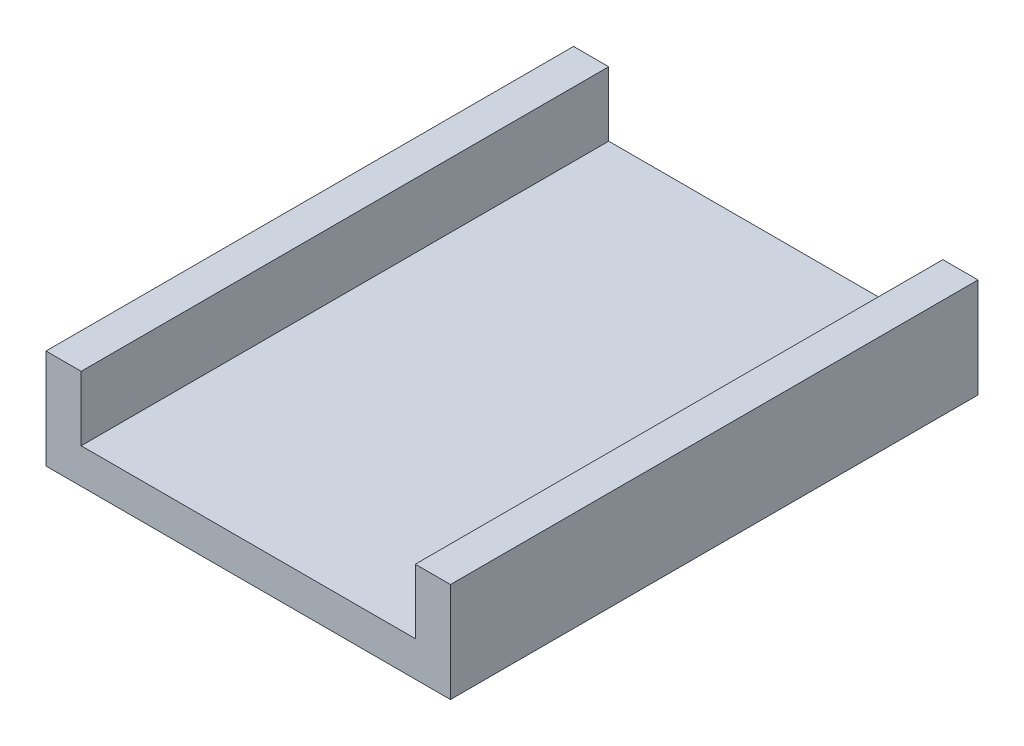
ISO-10303-21;
HEADER;
FILE_DESCRIPTION(('STEP AP214'),'2;1');
FILE_NAME('part.step','',(''),(''),'','','');
FILE_SCHEMA(('AUTOMOTIVE_DESIGN { 1 0 10303 214 1 1 1 1 }'));
ENDSEC;
DATA;
#1=APPLICATION_CONTEXT('core data for automotive mechanical design processes');
#2=APPLICATION_PROTOCOL_DEFINITION('international standard','automotive_design',2000,#1);
#3=PRODUCT_CONTEXT('',#1,'mechanical');
#4=PRODUCT('Part','Part','',(#3));
#5=PRODUCT_RELATED_PRODUCT_CATEGORY('part','',(#4));
#6=PRODUCT_DEFINITION_FORMATION('','',#4);
#7=PRODUCT_DEFINITION_CONTEXT('part definition',#1,'design');
#8=PRODUCT_DEFINITION('design','',#6,#7);
#9=PRODUCT_DEFINITION_SHAPE('','',#8);
#10=(LENGTH_UNIT() NAMED_UNIT(*) SI_UNIT(.MILLI.,.METRE.));
#11=(NAMED_UNIT(*) PLANE_ANGLE_UNIT() SI_UNIT($,.RADIAN.));
#12=(NAMED_UNIT(*) SI_UNIT($,.STERADIAN.) SOLID_ANGLE_UNIT());
#13=UNCERTAINTY_MEASURE_WITH_UNIT(LENGTH_MEASURE(1.E-05),#10,'distance_accuracy_value','');
#14=(GEOMETRIC_REPRESENTATION_CONTEXT(3) GLOBAL_UNCERTAINTY_ASSIGNED_CONTEXT((#13)) GLOBAL_UNIT_ASSIGNED_CONTEXT((#10,
#11,#12)) REPRESENTATION_CONTEXT('',''));
#15=CARTESIAN_POINT('',(0.,0.,0.));
#16=DIRECTION('',(0.,0.,1.));
#17=DIRECTION('',(1.,0.,0.));
#18=AXIS2_PLACEMENT_3D('',#15,#16,#17);
#19=CARTESIAN_POINT('',(0.,3.,0.));
#20=DIRECTION('',(0.,-1.,0.));
#21=DIRECTION('',(0.,0.,-1.));
#22=AXIS2_PLACEMENT_3D('',#19,#20,#21);
#23=PLANE('',#22);
#24=DIRECTION('',(0.,0.,1.));
#25=VECTOR('',#24,1.);
#26=CARTESIAN_POINT('',(14.25,3.,-22.5));
#27=LINE('',#26,#25);
#28=CARTESIAN_POINT('',(14.25,3.,-22.5));
#29=VERTEX_POINT('',#28);
#30=CARTESIAN_POINT('',(14.25,3.,22.5));
#31=VERTEX_POINT('',#30);
#32=EDGE_CURVE('E52',#29,#31,#27,.T.);
#33=ORIENTED_EDGE('',*,*,#32,.F.);
#34=DIRECTION('',(-1.,0.,0.));
#35=VECTOR('',#34,1.);
#36=CARTESIAN_POINT('',(-17.25,3.,-22.5));
#37=LINE('',#36,#35);
#38=CARTESIAN_POINT('',(-14.25,3.,-22.5));
#39=VERTEX_POINT('',#38);
#40=EDGE_CURVE('E38',#29,#39,#37,.T.);
#41=ORIENTED_EDGE('',*,*,#40,.T.);
#42=DIRECTION('',(0.,0.,-1.));
#43=VECTOR('',#42,1.);
#44=CARTESIAN_POINT('',(-14.25,3.,-22.5));
#45=LINE('',#44,#43);
#46=CARTESIAN_POINT('',(-14.25,3.,22.5));
#47=VERTEX_POINT('',#46);
#48=EDGE_CURVE('E122',#47,#39,#45,.T.);
#49=ORIENTED_EDGE('',*,*,#48,.F.);
#50=DIRECTION('',(1.,0.,0.));
#51=VECTOR('',#50,1.);
#52=CARTESIAN_POINT('',(-17.25,3.,22.5));
#53=LINE('',#52,#51);
#54=EDGE_CURVE('E57',#47,#31,#53,.T.);
#55=ORIENTED_EDGE('',*,*,#54,.T.);
#56=EDGE_LOOP('',(#33,#41,#49,#55));
#57=FACE_BOUND('',#56,.T.);
#58=ADVANCED_FACE('F34',(#57),#23,.F.);
#59=CARTESIAN_POINT('',(17.25,3.,22.5));
#60=DIRECTION('',(-1.,0.,0.));
#61=DIRECTION('',(0.,0.,1.));
#62=AXIS2_PLACEMENT_3D('',#59,#60,#61);
#63=PLANE('',#62);
#64=DIRECTION('',(0.,0.,-1.));
#65=VECTOR('',#64,1.);
#66=CARTESIAN_POINT('',(17.25,0.,22.5));
#67=LINE('',#66,#65);
#68=CARTESIAN_POINT('',(17.25,0.,22.5));
#69=VERTEX_POINT('',#68);
#70=CARTESIAN_POINT('',(17.25,0.,-22.5));
#71=VERTEX_POINT('',#70);
#72=EDGE_CURVE('E150',#69,#71,#67,.T.);
#73=ORIENTED_EDGE('',*,*,#72,.T.);
#74=DIRECTION('',(0.,-1.,0.));
#75=VECTOR('',#74,1.);
#76=CARTESIAN_POINT('',(17.25,3.,-22.5));
#77=LINE('',#76,#75);
#78=CARTESIAN_POINT('',(17.25,8.5,-22.5));
#79=VERTEX_POINT('',#78);
#80=EDGE_CURVE('E11',#79,#71,#77,.T.);
#81=ORIENTED_EDGE('',*,*,#80,.F.);
#82=DIRECTION('',(0.,0.,-1.));
#83=VECTOR('',#82,1.);
#84=CARTESIAN_POINT('',(17.25,8.5,-22.5));
#85=LINE('',#84,#83);
#86=CARTESIAN_POINT('',(17.25,8.5,22.5));
#87=VERTEX_POINT('',#86);
#88=EDGE_CURVE('E117',#87,#79,#85,.T.);
#89=ORIENTED_EDGE('',*,*,#88,.F.);
#90=DIRECTION('',(0.,-1.,0.));
#91=VECTOR('',#90,1.);
#92=CARTESIAN_POINT('',(17.25,3.,22.5));
#93=LINE('',#92,#91);
#94=EDGE_CURVE('E168',#87,#69,#93,.T.);
#95=ORIENTED_EDGE('',*,*,#94,.T.);
#96=EDGE_LOOP('',(#73,#81,#89,#95));
#97=FACE_BOUND('',#96,.T.);
#98=ADVANCED_FACE('F36',(#97),#63,.F.);
#99=CARTESIAN_POINT('',(-17.25,3.,-22.5));
#100=DIRECTION('',(0.,0.,1.));
#101=DIRECTION('',(1.,0.,0.));
#102=AXIS2_PLACEMENT_3D('',#99,#100,#101);
#103=PLANE('',#102);
#104=DIRECTION('',(-1.,0.,0.));
#105=VECTOR('',#104,1.);
#106=CARTESIAN_POINT('',(-17.25,0.,-22.5));
#107=LINE('',#106,#105);
#108=CARTESIAN_POINT('',(-17.25,0.,-22.5));
#109=VERTEX_POINT('',#108);
#110=EDGE_CURVE('E156',#71,#109,#107,.T.);
#111=ORIENTED_EDGE('',*,*,#110,.T.);
#112=DIRECTION('',(0.,-1.,0.));
#113=VECTOR('',#112,1.);
#114=CARTESIAN_POINT('',(-17.25,3.,-22.5));
#115=LINE('',#114,#113);
#116=CARTESIAN_POINT('',(-17.25,8.5,-22.5));
#117=VERTEX_POINT('',#116);
#118=EDGE_CURVE('E44',#117,#109,#115,.T.);
#119=ORIENTED_EDGE('',*,*,#118,.F.);
#120=DIRECTION('',(-1.,0.,0.));
#121=VECTOR('',#120,1.);
#122=CARTESIAN_POINT('',(-14.25,8.5,-22.5));
#123=LINE('',#122,#121);
#124=CARTESIAN_POINT('',(-14.25,8.5,-22.5));
#125=VERTEX_POINT('',#124);
#126=EDGE_CURVE('E125',#125,#117,#123,.T.);
#127=ORIENTED_EDGE('',*,*,#126,.F.);
#128=DIRECTION('',(0.,-1.,0.));
#129=VECTOR('',#128,1.);
#130=CARTESIAN_POINT('',(-14.25,8.5,-22.5));
#131=LINE('',#130,#129);
#132=EDGE_CURVE('E139',#125,#39,#131,.T.);
#133=ORIENTED_EDGE('',*,*,#132,.T.);
#134=ORIENTED_EDGE('',*,*,#40,.F.);
#135=DIRECTION('',(0.,-1.,0.));
#136=VECTOR('',#135,1.);
#137=CARTESIAN_POINT('',(14.25,8.5,-22.5));
#138=LINE('',#137,#136);
#139=CARTESIAN_POINT('',(14.25,8.5,-22.5));
#140=VERTEX_POINT('',#139);
#141=EDGE_CURVE('E104',#140,#29,#138,.T.);
#142=ORIENTED_EDGE('',*,*,#141,.F.);
#143=DIRECTION('',(-1.,0.,0.));
#144=VECTOR('',#143,1.);
#145=CARTESIAN_POINT('',(14.25,8.5,-22.5));
#146=LINE('',#145,#144);
#147=EDGE_CURVE('E111',#79,#140,#146,.T.);
#148=ORIENTED_EDGE('',*,*,#147,.F.);
#149=ORIENTED_EDGE('',*,*,#80,.T.);
#150=EDGE_LOOP('',(#111,#119,#127,#133,#134,#142,#148,#149));
#151=FACE_BOUND('',#150,.T.);
#152=ADVANCED_FACE('F120',(#151),#103,.F.);
#153=CARTESIAN_POINT('',(-17.25,3.,22.5));
#154=DIRECTION('',(1.,0.,0.));
#155=DIRECTION('',(0.,0.,-1.));
#156=AXIS2_PLACEMENT_3D('',#153,#154,#155);
#157=PLANE('',#156);
#158=DIRECTION('',(0.,0.,1.));
#159=VECTOR('',#158,1.);
#160=CARTESIAN_POINT('',(-17.25,0.,22.5));
#161=LINE('',#160,#159);
#162=CARTESIAN_POINT('',(-17.25,0.,22.5));
#163=VERTEX_POINT('',#162);
#164=EDGE_CURVE('E161',#109,#163,#161,.T.);
#165=ORIENTED_EDGE('',*,*,#164,.T.);
#166=DIRECTION('',(0.,-1.,0.));
#167=VECTOR('',#166,1.);
#168=CARTESIAN_POINT('',(-17.25,3.,22.5));
#169=LINE('',#168,#167);
#170=CARTESIAN_POINT('',(-17.25,8.5,22.5));
#171=VERTEX_POINT('',#170);
#172=EDGE_CURVE('E170',#171,#163,#169,.T.);
#173=ORIENTED_EDGE('',*,*,#172,.F.);
#174=DIRECTION('',(0.,0.,1.));
#175=VECTOR('',#174,1.);
#176=CARTESIAN_POINT('',(-17.25,8.5,-22.5));
#177=LINE('',#176,#175);
#178=EDGE_CURVE('E132',#117,#171,#177,.T.);
#179=ORIENTED_EDGE('',*,*,#178,.F.);
#180=ORIENTED_EDGE('',*,*,#118,.T.);
#181=EDGE_LOOP('',(#165,#173,#179,#180));
#182=FACE_BOUND('',#181,.T.);
#183=ADVANCED_FACE('F177',(#182),#157,.F.);
#184=CARTESIAN_POINT('',(-17.25,3.,22.5));
#185=DIRECTION('',(0.,0.,-1.));
#186=DIRECTION('',(-1.,0.,0.));
#187=AXIS2_PLACEMENT_3D('',#184,#185,#186);
#188=PLANE('',#187);
#189=DIRECTION('',(1.,0.,0.));
#190=VECTOR('',#189,1.);
#191=CARTESIAN_POINT('',(-17.25,0.,22.5));
#192=LINE('',#191,#190);
#193=EDGE_CURVE('E166',#163,#69,#192,.T.);
#194=ORIENTED_EDGE('',*,*,#193,.T.);
#195=ORIENTED_EDGE('',*,*,#94,.F.);
#196=DIRECTION('',(1.,0.,0.));
#197=VECTOR('',#196,1.);
#198=CARTESIAN_POINT('',(17.25,8.5,22.5));
#199=LINE('',#198,#197);
#200=CARTESIAN_POINT('',(14.25,8.5,22.5));
#201=VERTEX_POINT('',#200);
#202=EDGE_CURVE('E110',#201,#87,#199,.T.);
#203=ORIENTED_EDGE('',*,*,#202,.F.);
#204=DIRECTION('',(0.,-1.,0.));
#205=VECTOR('',#204,1.);
#206=CARTESIAN_POINT('',(14.25,8.5,22.5));
#207=LINE('',#206,#205);
#208=EDGE_CURVE('E106',#201,#31,#207,.T.);
#209=ORIENTED_EDGE('',*,*,#208,.T.);
#210=ORIENTED_EDGE('',*,*,#54,.F.);
#211=DIRECTION('',(0.,-1.,0.));
#212=VECTOR('',#211,1.);
#213=CARTESIAN_POINT('',(-14.25,8.5,22.5));
#214=LINE('',#213,#212);
#215=CARTESIAN_POINT('',(-14.25,8.5,22.5));
#216=VERTEX_POINT('',#215);
#217=EDGE_CURVE('E146',#216,#47,#214,.T.);
#218=ORIENTED_EDGE('',*,*,#217,.F.);
#219=DIRECTION('',(1.,0.,0.));
#220=VECTOR('',#219,1.);
#221=CARTESIAN_POINT('',(-17.25,8.5,22.5));
#222=LINE('',#221,#220);
#223=EDGE_CURVE('E135',#171,#216,#222,.T.);
#224=ORIENTED_EDGE('',*,*,#223,.F.);
#225=ORIENTED_EDGE('',*,*,#172,.T.);
#226=EDGE_LOOP('',(#194,#195,#203,#209,#210,#218,#224,#225));
#227=FACE_BOUND('',#226,.T.);
#228=ADVANCED_FACE('F183',(#227),#188,.F.);
#229=CARTESIAN_POINT('',(0.,0.,0.));
#230=DIRECTION('',(0.,-1.,0.));
#231=DIRECTION('',(0.,0.,-1.));
#232=AXIS2_PLACEMENT_3D('',#229,#230,#231);
#233=PLANE('',#232);
#234=ORIENTED_EDGE('',*,*,#72,.F.);
#235=ORIENTED_EDGE('',*,*,#193,.F.);
#236=ORIENTED_EDGE('',*,*,#164,.F.);
#237=ORIENTED_EDGE('',*,*,#110,.F.);
#238=EDGE_LOOP('',(#234,#235,#236,#237));
#239=FACE_BOUND('',#238,.T.);
#240=ADVANCED_FACE('F181',(#239),#233,.T.);
#241=CARTESIAN_POINT('',(-14.25,8.5,-22.5));
#242=DIRECTION('',(-1.,0.,0.));
#243=DIRECTION('',(0.,0.,1.));
#244=AXIS2_PLACEMENT_3D('',#241,#242,#243);
#245=PLANE('',#244);
#246=ORIENTED_EDGE('',*,*,#48,.T.);
#247=ORIENTED_EDGE('',*,*,#132,.F.);
#248=DIRECTION('',(0.,0.,-1.));
#249=VECTOR('',#248,1.);
#250=CARTESIAN_POINT('',(-14.25,8.5,-22.5));
#251=LINE('',#250,#249);
#252=EDGE_CURVE('E137',#216,#125,#251,.T.);
#253=ORIENTED_EDGE('',*,*,#252,.F.);
#254=ORIENTED_EDGE('',*,*,#217,.T.);
#255=EDGE_LOOP('',(#246,#247,#253,#254));
#256=FACE_BOUND('',#255,.T.);
#257=ADVANCED_FACE('F188',(#256),#245,.F.);
#258=CARTESIAN_POINT('',(0.,8.5,0.));
#259=DIRECTION('',(0.,1.,0.));
#260=DIRECTION('',(0.,0.,1.));
#261=AXIS2_PLACEMENT_3D('',#258,#259,#260);
#262=PLANE('',#261);
#263=ORIENTED_EDGE('',*,*,#126,.T.);
#264=ORIENTED_EDGE('',*,*,#178,.T.);
#265=ORIENTED_EDGE('',*,*,#223,.T.);
#266=ORIENTED_EDGE('',*,*,#252,.T.);
#267=EDGE_LOOP('',(#263,#264,#265,#266));
#268=FACE_BOUND('',#267,.T.);
#269=ADVANCED_FACE('F190',(#268),#262,.T.);
#270=CARTESIAN_POINT('',(14.25,8.5,-22.5));
#271=DIRECTION('',(1.,0.,0.));
#272=DIRECTION('',(0.,0.,-1.));
#273=AXIS2_PLACEMENT_3D('',#270,#271,#272);
#274=PLANE('',#273);
#275=ORIENTED_EDGE('',*,*,#32,.T.);
#276=ORIENTED_EDGE('',*,*,#208,.F.);
#277=DIRECTION('',(0.,0.,1.));
#278=VECTOR('',#277,1.);
#279=CARTESIAN_POINT('',(14.25,8.5,-22.5));
#280=LINE('',#279,#278);
#281=EDGE_CURVE('E100',#140,#201,#280,.T.);
#282=ORIENTED_EDGE('',*,*,#281,.F.);
#283=ORIENTED_EDGE('',*,*,#141,.T.);
#284=EDGE_LOOP('',(#275,#276,#282,#283));
#285=FACE_BOUND('',#284,.T.);
#286=ADVANCED_FACE('F102',(#285),#274,.F.);
#287=CARTESIAN_POINT('',(0.,8.5,0.));
#288=DIRECTION('',(0.,-1.,0.));
#289=DIRECTION('',(0.,0.,-1.));
#290=AXIS2_PLACEMENT_3D('',#287,#288,#289);
#291=PLANE('',#290);
#292=ORIENTED_EDGE('',*,*,#147,.T.);
#293=ORIENTED_EDGE('',*,*,#281,.T.);
#294=ORIENTED_EDGE('',*,*,#202,.T.);
#295=ORIENTED_EDGE('',*,*,#88,.T.);
#296=EDGE_LOOP('',(#292,#293,#294,#295));
#297=FACE_BOUND('',#296,.T.);
#298=ADVANCED_FACE('F115',(#297),#291,.F.);
#299=CLOSED_SHELL('',(#58,#98,#152,#183,#228,#240,#257,#269,#286,#298));
#300=MANIFOLD_SOLID_BREP('B2',#299);
#301=ADVANCED_BREP_SHAPE_REPRESENTATION('',(#18,#300),#14);
#302=SHAPE_DEFINITION_REPRESENTATION(#9,#301);
ENDSEC;
END-ISO-10303-21;
